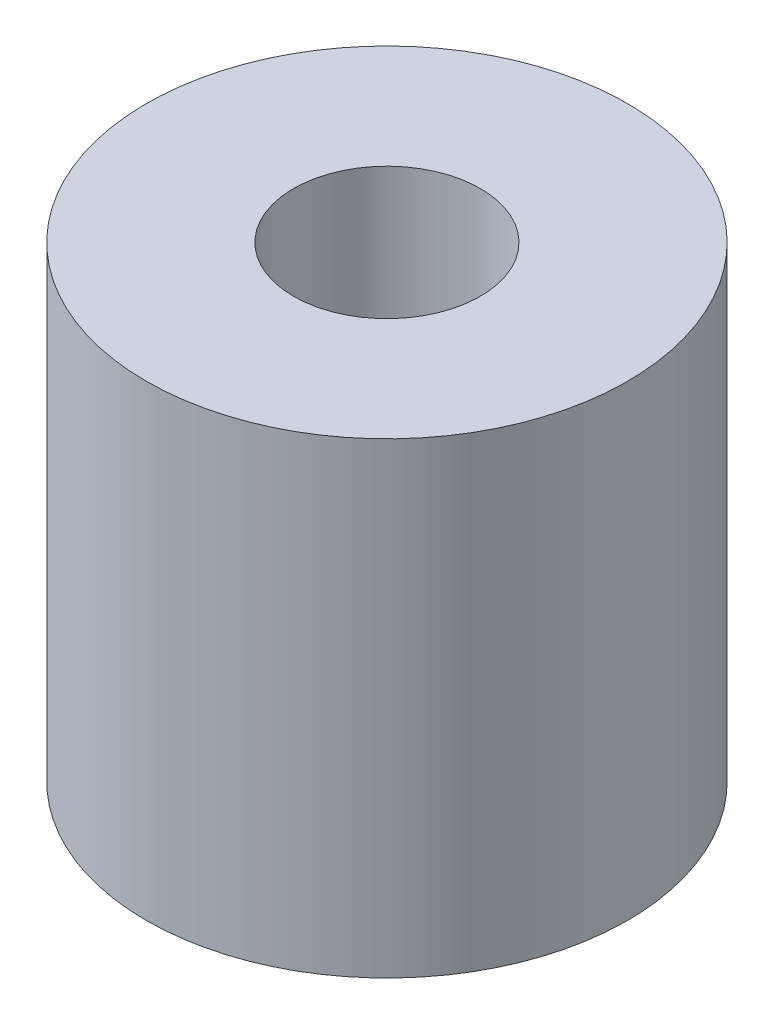
ISO-10303-21;
HEADER;
FILE_DESCRIPTION(('STEP AP214'),'2;1');
FILE_NAME('part.step','',(''),(''),'','','');
FILE_SCHEMA(('AUTOMOTIVE_DESIGN { 1 0 10303 214 1 1 1 1 }'));
ENDSEC;
DATA;
#1=APPLICATION_CONTEXT('core data for automotive mechanical design processes');
#2=APPLICATION_PROTOCOL_DEFINITION('international standard','automotive_design',2000,#1);
#3=PRODUCT_CONTEXT('',#1,'mechanical');
#4=PRODUCT('Part','Part','',(#3));
#5=PRODUCT_RELATED_PRODUCT_CATEGORY('part','',(#4));
#6=PRODUCT_DEFINITION_FORMATION('','',#4);
#7=PRODUCT_DEFINITION_CONTEXT('part definition',#1,'design');
#8=PRODUCT_DEFINITION('design','',#6,#7);
#9=PRODUCT_DEFINITION_SHAPE('','',#8);
#10=(LENGTH_UNIT() NAMED_UNIT(*) SI_UNIT(.MILLI.,.METRE.));
#11=(NAMED_UNIT(*) PLANE_ANGLE_UNIT() SI_UNIT($,.RADIAN.));
#12=(NAMED_UNIT(*) SI_UNIT($,.STERADIAN.) SOLID_ANGLE_UNIT());
#13=UNCERTAINTY_MEASURE_WITH_UNIT(LENGTH_MEASURE(1.E-05),#10,'distance_accuracy_value','');
#14=(GEOMETRIC_REPRESENTATION_CONTEXT(3) GLOBAL_UNCERTAINTY_ASSIGNED_CONTEXT((#13)) GLOBAL_UNIT_ASSIGNED_CONTEXT((#10,
#11,#12)) REPRESENTATION_CONTEXT('',''));
#15=CARTESIAN_POINT('',(0.,0.,0.));
#16=DIRECTION('',(0.,0.,1.));
#17=DIRECTION('',(1.,0.,0.));
#18=AXIS2_PLACEMENT_3D('',#15,#16,#17);
#19=CARTESIAN_POINT('',(0.,0.,0.));
#20=DIRECTION('',(0.,1.,0.));
#21=DIRECTION('',(0.,0.,1.));
#22=AXIS2_PLACEMENT_3D('',#19,#20,#21);
#23=PLANE('',#22);
#24=CARTESIAN_POINT('',(0.,0.,0.));
#25=DIRECTION('',(0.,1.,0.));
#26=DIRECTION('',(0.,0.,1.));
#27=AXIS2_PLACEMENT_3D('',#24,#25,#26);
#28=CIRCLE('',#27,3.3);
#29=CARTESIAN_POINT('',(0.,0.,3.3));
#30=VERTEX_POINT('',#29);
#31=EDGE_CURVE('E11',#30,#30,#28,.T.);
#32=ORIENTED_EDGE('',*,*,#31,.T.);
#33=EDGE_LOOP('',(#32));
#34=FACE_BOUND('',#33,.T.);
#35=DIRECTION('',(-0.5,0.,0.866025403784439));
#36=VECTOR('',#35,1.);
#37=CARTESIAN_POINT('',(-4.80644099100363,0.,-2.775));
#38=LINE('',#37,#36);
#39=CARTESIAN_POINT('',(-3.20429399400242,0.,-5.55));
#40=VERTEX_POINT('',#39);
#41=CARTESIAN_POINT('',(-6.40858798800485,0.,0.));
#42=VERTEX_POINT('',#41);
#43=EDGE_CURVE('E51',#40,#42,#38,.T.);
#44=ORIENTED_EDGE('',*,*,#43,.F.);
#45=DIRECTION('',(-1.,0.,0.));
#46=VECTOR('',#45,1.);
#47=CARTESIAN_POINT('',(0.,0.,-5.55));
#48=LINE('',#47,#46);
#49=CARTESIAN_POINT('',(3.20429399400243,0.,-5.55));
#50=VERTEX_POINT('',#49);
#51=EDGE_CURVE('E55',#50,#40,#48,.T.);
#52=ORIENTED_EDGE('',*,*,#51,.F.);
#53=DIRECTION('',(-0.5,0.,-0.866025403784439));
#54=VECTOR('',#53,1.);
#55=CARTESIAN_POINT('',(4.80644099100364,0.,-2.775));
#56=LINE('',#55,#54);
#57=CARTESIAN_POINT('',(6.40858798800485,0.,0.));
#58=VERTEX_POINT('',#57);
#59=EDGE_CURVE('E128',#58,#50,#56,.T.);
#60=ORIENTED_EDGE('',*,*,#59,.F.);
#61=DIRECTION('',(0.5,0.,-0.866025403784439));
#62=VECTOR('',#61,1.);
#63=CARTESIAN_POINT('',(4.80644099100363,0.,2.775));
#64=LINE('',#63,#62);
#65=CARTESIAN_POINT('',(3.20429399400242,0.,5.55));
#66=VERTEX_POINT('',#65);
#67=EDGE_CURVE('E130',#66,#58,#64,.T.);
#68=ORIENTED_EDGE('',*,*,#67,.F.);
#69=DIRECTION('',(1.,0.,0.));
#70=VECTOR('',#69,1.);
#71=CARTESIAN_POINT('',(0.,0.,5.55));
#72=LINE('',#71,#70);
#73=CARTESIAN_POINT('',(-3.20429399400243,0.,5.55));
#74=VERTEX_POINT('',#73);
#75=EDGE_CURVE('E111',#74,#66,#72,.T.);
#76=ORIENTED_EDGE('',*,*,#75,.F.);
#77=DIRECTION('',(0.5,0.,0.866025403784439));
#78=VECTOR('',#77,1.);
#79=CARTESIAN_POINT('',(-4.80644099100364,0.,2.775));
#80=LINE('',#79,#78);
#81=EDGE_CURVE('E108',#42,#74,#80,.T.);
#82=ORIENTED_EDGE('',*,*,#81,.F.);
#83=EDGE_LOOP('',(#44,#52,#60,#68,#76,#82));
#84=FACE_BOUND('',#83,.T.);
#85=ADVANCED_FACE('F36',(#34,#84),#23,.F.);
#86=CARTESIAN_POINT('',(0.,2.,0.));
#87=DIRECTION('',(0.,-1.,0.));
#88=DIRECTION('',(0.,0.,-1.));
#89=AXIS2_PLACEMENT_3D('',#86,#87,#88);
#90=CYLINDRICAL_SURFACE('',#89,3.3);
#91=ORIENTED_EDGE('',*,*,#31,.F.);
#92=EDGE_LOOP('',(#91));
#93=FACE_BOUND('',#92,.T.);
#94=CARTESIAN_POINT('',(0.,11.,0.));
#95=DIRECTION('',(0.,1.,0.));
#96=DIRECTION('',(0.,0.,1.));
#97=AXIS2_PLACEMENT_3D('',#94,#95,#96);
#98=CIRCLE('',#97,3.3);
#99=CARTESIAN_POINT('',(0.,11.,3.3));
#100=VERTEX_POINT('',#99);
#101=EDGE_CURVE('E185',#100,#100,#98,.T.);
#102=ORIENTED_EDGE('',*,*,#101,.T.);
#103=EDGE_LOOP('',(#102));
#104=FACE_BOUND('',#103,.T.);
#105=ADVANCED_FACE('F38',(#93,#104),#90,.F.);
#106=CARTESIAN_POINT('',(0.,2.,0.));
#107=DIRECTION('',(0.,-1.,0.));
#108=DIRECTION('',(0.,0.,-1.));
#109=AXIS2_PLACEMENT_3D('',#106,#107,#108);
#110=CYLINDRICAL_SURFACE('',#109,8.5);
#111=CARTESIAN_POINT('',(0.,-5.5,0.));
#112=DIRECTION('',(0.,1.,0.));
#113=DIRECTION('',(0.,0.,1.));
#114=AXIS2_PLACEMENT_3D('',#111,#112,#113);
#115=CIRCLE('',#114,8.5);
#116=CARTESIAN_POINT('',(0.,-5.5,8.5));
#117=VERTEX_POINT('',#116);
#118=EDGE_CURVE('E105',#117,#117,#115,.T.);
#119=ORIENTED_EDGE('',*,*,#118,.T.);
#120=EDGE_LOOP('',(#119));
#121=FACE_BOUND('',#120,.T.);
#122=CARTESIAN_POINT('',(0.,11.,0.));
#123=DIRECTION('',(0.,1.,0.));
#124=DIRECTION('',(0.,0.,1.));
#125=AXIS2_PLACEMENT_3D('',#122,#123,#124);
#126=CIRCLE('',#125,8.5);
#127=CARTESIAN_POINT('',(0.,11.,8.5));
#128=VERTEX_POINT('',#127);
#129=EDGE_CURVE('E114',#128,#128,#126,.T.);
#130=ORIENTED_EDGE('',*,*,#129,.F.);
#131=EDGE_LOOP('',(#130));
#132=FACE_BOUND('',#131,.T.);
#133=ADVANCED_FACE('F165',(#121,#132),#110,.T.);
#134=CARTESIAN_POINT('',(-4.80644099100363,-5.5,-2.775));
#135=DIRECTION('',(-0.866025403784439,0.,-0.5));
#136=DIRECTION('',(-0.5,0.,0.866025403784439));
#137=AXIS2_PLACEMENT_3D('',#134,#135,#136);
#138=PLANE('',#137);
#139=ORIENTED_EDGE('',*,*,#43,.T.);
#140=DIRECTION('',(0.,1.,0.));
#141=VECTOR('',#140,1.);
#142=CARTESIAN_POINT('',(-6.40858798800485,-5.5,0.));
#143=LINE('',#142,#141);
#144=CARTESIAN_POINT('',(-6.40858798800485,-5.5,0.));
#145=VERTEX_POINT('',#144);
#146=EDGE_CURVE('E44',#145,#42,#143,.T.);
#147=ORIENTED_EDGE('',*,*,#146,.F.);
#148=DIRECTION('',(-0.5,0.,0.866025403784439));
#149=VECTOR('',#148,1.);
#150=CARTESIAN_POINT('',(-4.80644099100363,-5.5,-2.775));
#151=LINE('',#150,#149);
#152=CARTESIAN_POINT('',(-3.20429399400242,-5.5,-5.55));
#153=VERTEX_POINT('',#152);
#154=EDGE_CURVE('E92',#153,#145,#151,.T.);
#155=ORIENTED_EDGE('',*,*,#154,.F.);
#156=DIRECTION('',(0.,1.,0.));
#157=VECTOR('',#156,1.);
#158=CARTESIAN_POINT('',(-3.20429399400242,-5.5,-5.55));
#159=LINE('',#158,#157);
#160=EDGE_CURVE('E101',#153,#40,#159,.T.);
#161=ORIENTED_EDGE('',*,*,#160,.T.);
#162=EDGE_LOOP('',(#139,#147,#155,#161));
#163=FACE_BOUND('',#162,.T.);
#164=ADVANCED_FACE('F106',(#163),#138,.F.);
#165=CARTESIAN_POINT('',(-4.80644099100364,-5.5,2.775));
#166=DIRECTION('',(-0.866025403784439,0.,0.5));
#167=DIRECTION('',(0.5,0.,0.866025403784439));
#168=AXIS2_PLACEMENT_3D('',#165,#166,#167);
#169=PLANE('',#168);
#170=ORIENTED_EDGE('',*,*,#81,.T.);
#171=DIRECTION('',(0.,1.,0.));
#172=VECTOR('',#171,1.);
#173=CARTESIAN_POINT('',(-3.20429399400243,-5.5,5.55));
#174=LINE('',#173,#172);
#175=CARTESIAN_POINT('',(-3.20429399400243,-5.5,5.55));
#176=VERTEX_POINT('',#175);
#177=EDGE_CURVE('E136',#176,#74,#174,.T.);
#178=ORIENTED_EDGE('',*,*,#177,.F.);
#179=DIRECTION('',(0.5,0.,0.866025403784439));
#180=VECTOR('',#179,1.);
#181=CARTESIAN_POINT('',(-4.80644099100364,-5.5,2.775));
#182=LINE('',#181,#180);
#183=EDGE_CURVE('E122',#145,#176,#182,.T.);
#184=ORIENTED_EDGE('',*,*,#183,.F.);
#185=ORIENTED_EDGE('',*,*,#146,.T.);
#186=EDGE_LOOP('',(#170,#178,#184,#185));
#187=FACE_BOUND('',#186,.T.);
#188=ADVANCED_FACE('F157',(#187),#169,.F.);
#189=CARTESIAN_POINT('',(0.,-5.5,5.55));
#190=DIRECTION('',(0.,0.,1.));
#191=DIRECTION('',(1.,0.,0.));
#192=AXIS2_PLACEMENT_3D('',#189,#190,#191);
#193=PLANE('',#192);
#194=ORIENTED_EDGE('',*,*,#75,.T.);
#195=DIRECTION('',(0.,1.,0.));
#196=VECTOR('',#195,1.);
#197=CARTESIAN_POINT('',(3.20429399400242,-5.5,5.55));
#198=LINE('',#197,#196);
#199=CARTESIAN_POINT('',(3.20429399400242,-5.5,5.55));
#200=VERTEX_POINT('',#199);
#201=EDGE_CURVE('E139',#200,#66,#198,.T.);
#202=ORIENTED_EDGE('',*,*,#201,.F.);
#203=DIRECTION('',(1.,0.,0.));
#204=VECTOR('',#203,1.);
#205=CARTESIAN_POINT('',(0.,-5.5,5.55));
#206=LINE('',#205,#204);
#207=EDGE_CURVE('E120',#176,#200,#206,.T.);
#208=ORIENTED_EDGE('',*,*,#207,.F.);
#209=ORIENTED_EDGE('',*,*,#177,.T.);
#210=EDGE_LOOP('',(#194,#202,#208,#209));
#211=FACE_BOUND('',#210,.T.);
#212=ADVANCED_FACE('F154',(#211),#193,.F.);
#213=CARTESIAN_POINT('',(4.80644099100363,-5.5,2.775));
#214=DIRECTION('',(0.866025403784438,0.,0.5));
#215=DIRECTION('',(0.5,0.,-0.866025403784439));
#216=AXIS2_PLACEMENT_3D('',#213,#214,#215);
#217=PLANE('',#216);
#218=ORIENTED_EDGE('',*,*,#67,.T.);
#219=DIRECTION('',(0.,1.,0.));
#220=VECTOR('',#219,1.);
#221=CARTESIAN_POINT('',(6.40858798800485,-5.5,0.));
#222=LINE('',#221,#220);
#223=CARTESIAN_POINT('',(6.40858798800485,-5.5,0.));
#224=VERTEX_POINT('',#223);
#225=EDGE_CURVE('E142',#224,#58,#222,.T.);
#226=ORIENTED_EDGE('',*,*,#225,.F.);
#227=DIRECTION('',(0.5,0.,-0.866025403784439));
#228=VECTOR('',#227,1.);
#229=CARTESIAN_POINT('',(4.80644099100363,-5.5,2.775));
#230=LINE('',#229,#228);
#231=EDGE_CURVE('E118',#200,#224,#230,.T.);
#232=ORIENTED_EDGE('',*,*,#231,.F.);
#233=ORIENTED_EDGE('',*,*,#201,.T.);
#234=EDGE_LOOP('',(#218,#226,#232,#233));
#235=FACE_BOUND('',#234,.T.);
#236=ADVANCED_FACE('F149',(#235),#217,.F.);
#237=CARTESIAN_POINT('',(4.80644099100364,-5.5,-2.775));
#238=DIRECTION('',(0.866025403784439,0.,-0.5));
#239=DIRECTION('',(-0.5,0.,-0.866025403784439));
#240=AXIS2_PLACEMENT_3D('',#237,#238,#239);
#241=PLANE('',#240);
#242=ORIENTED_EDGE('',*,*,#59,.T.);
#243=DIRECTION('',(0.,1.,0.));
#244=VECTOR('',#243,1.);
#245=CARTESIAN_POINT('',(3.20429399400243,-5.5,-5.55));
#246=LINE('',#245,#244);
#247=CARTESIAN_POINT('',(3.20429399400243,-5.5,-5.55));
#248=VERTEX_POINT('',#247);
#249=EDGE_CURVE('E104',#248,#50,#246,.T.);
#250=ORIENTED_EDGE('',*,*,#249,.F.);
#251=DIRECTION('',(-0.5,0.,-0.866025403784439));
#252=VECTOR('',#251,1.);
#253=CARTESIAN_POINT('',(4.80644099100364,-5.5,-2.775));
#254=LINE('',#253,#252);
#255=EDGE_CURVE('E95',#224,#248,#254,.T.);
#256=ORIENTED_EDGE('',*,*,#255,.F.);
#257=ORIENTED_EDGE('',*,*,#225,.T.);
#258=EDGE_LOOP('',(#242,#250,#256,#257));
#259=FACE_BOUND('',#258,.T.);
#260=ADVANCED_FACE('F146',(#259),#241,.F.);
#261=CARTESIAN_POINT('',(0.,-5.5,-5.55));
#262=DIRECTION('',(0.,0.,-1.));
#263=DIRECTION('',(-1.,0.,0.));
#264=AXIS2_PLACEMENT_3D('',#261,#262,#263);
#265=PLANE('',#264);
#266=ORIENTED_EDGE('',*,*,#51,.T.);
#267=ORIENTED_EDGE('',*,*,#160,.F.);
#268=DIRECTION('',(-1.,0.,0.));
#269=VECTOR('',#268,1.);
#270=CARTESIAN_POINT('',(0.,-5.5,-5.55));
#271=LINE('',#270,#269);
#272=EDGE_CURVE('E87',#248,#153,#271,.T.);
#273=ORIENTED_EDGE('',*,*,#272,.F.);
#274=ORIENTED_EDGE('',*,*,#249,.T.);
#275=EDGE_LOOP('',(#266,#267,#273,#274));
#276=FACE_BOUND('',#275,.T.);
#277=ADVANCED_FACE('F102',(#276),#265,.F.);
#278=CARTESIAN_POINT('',(0.,-5.5,0.));
#279=DIRECTION('',(0.,1.,0.));
#280=DIRECTION('',(0.,0.,1.));
#281=AXIS2_PLACEMENT_3D('',#278,#279,#280);
#282=PLANE('',#281);
#283=ORIENTED_EDGE('',*,*,#154,.T.);
#284=ORIENTED_EDGE('',*,*,#183,.T.);
#285=ORIENTED_EDGE('',*,*,#207,.T.);
#286=ORIENTED_EDGE('',*,*,#231,.T.);
#287=ORIENTED_EDGE('',*,*,#255,.T.);
#288=ORIENTED_EDGE('',*,*,#272,.T.);
#289=EDGE_LOOP('',(#283,#284,#285,#286,#287,#288));
#290=FACE_BOUND('',#289,.T.);
#291=ORIENTED_EDGE('',*,*,#118,.F.);
#292=EDGE_LOOP('',(#291));
#293=FACE_BOUND('',#292,.T.);
#294=ADVANCED_FACE('F89',(#290,#293),#282,.F.);
#295=CARTESIAN_POINT('',(0.,11.,0.));
#296=DIRECTION('',(0.,1.,0.));
#297=DIRECTION('',(0.,0.,1.));
#298=AXIS2_PLACEMENT_3D('',#295,#296,#297);
#299=PLANE('',#298);
#300=ORIENTED_EDGE('',*,*,#129,.T.);
#301=EDGE_LOOP('',(#300));
#302=FACE_BOUND('',#301,.T.);
#303=ORIENTED_EDGE('',*,*,#101,.F.);
#304=EDGE_LOOP('',(#303));
#305=FACE_BOUND('',#304,.T.);
#306=ADVANCED_FACE('F190',(#302,#305),#299,.T.);
#307=CLOSED_SHELL('',(#85,#105,#133,#164,#188,#212,#236,#260,#277,#294,#306));
#308=MANIFOLD_SOLID_BREP('B2',#307);
#309=ADVANCED_BREP_SHAPE_REPRESENTATION('',(#18,#308),#14);
#310=SHAPE_DEFINITION_REPRESENTATION(#9,#309);
ENDSEC;
END-ISO-10303-21;
